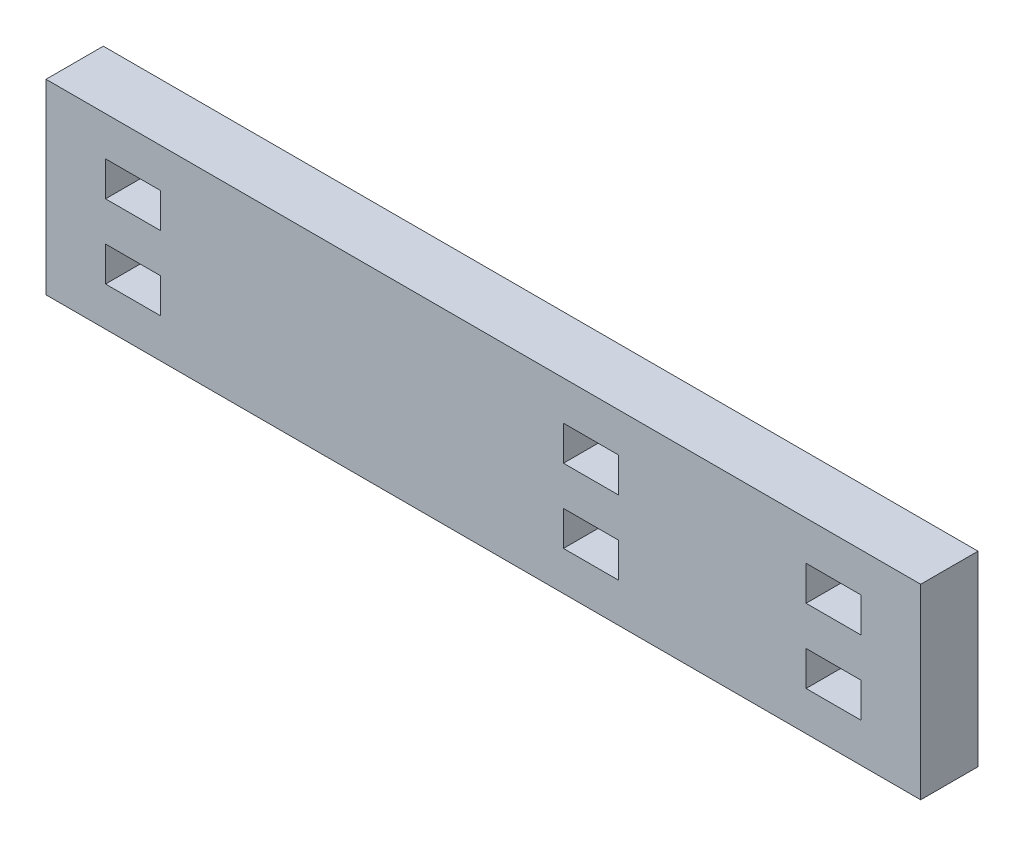
ISO-10303-21;
HEADER;
FILE_DESCRIPTION(('STEP AP214'),'2;1');
FILE_NAME('part.step','',(''),(''),'','','');
FILE_SCHEMA(('AUTOMOTIVE_DESIGN { 1 0 10303 214 1 1 1 1 }'));
ENDSEC;
DATA;
#1=APPLICATION_CONTEXT('core data for automotive mechanical design processes');
#2=APPLICATION_PROTOCOL_DEFINITION('international standard','automotive_design',2000,#1);
#3=PRODUCT_CONTEXT('',#1,'mechanical');
#4=PRODUCT('Part','Part','',(#3));
#5=PRODUCT_RELATED_PRODUCT_CATEGORY('part','',(#4));
#6=PRODUCT_DEFINITION_FORMATION('','',#4);
#7=PRODUCT_DEFINITION_CONTEXT('part definition',#1,'design');
#8=PRODUCT_DEFINITION('design','',#6,#7);
#9=PRODUCT_DEFINITION_SHAPE('','',#8);
#10=(LENGTH_UNIT() NAMED_UNIT(*) SI_UNIT(.MILLI.,.METRE.));
#11=(NAMED_UNIT(*) PLANE_ANGLE_UNIT() SI_UNIT($,.RADIAN.));
#12=(NAMED_UNIT(*) SI_UNIT($,.STERADIAN.) SOLID_ANGLE_UNIT());
#13=UNCERTAINTY_MEASURE_WITH_UNIT(LENGTH_MEASURE(1.E-05),#10,'distance_accuracy_value','');
#14=(GEOMETRIC_REPRESENTATION_CONTEXT(3) GLOBAL_UNCERTAINTY_ASSIGNED_CONTEXT((#13)) GLOBAL_UNIT_ASSIGNED_CONTEXT((#10,
#11,#12)) REPRESENTATION_CONTEXT('',''));
#15=CARTESIAN_POINT('',(0.,0.,0.));
#16=DIRECTION('',(0.,0.,1.));
#17=DIRECTION('',(1.,0.,0.));
#18=AXIS2_PLACEMENT_3D('',#15,#16,#17);
#19=CARTESIAN_POINT('',(-0.1,-0.1,5.15));
#20=DIRECTION('',(0.,0.,-1.));
#21=DIRECTION('',(-1.,0.,0.));
#22=AXIS2_PLACEMENT_3D('',#19,#20,#21);
#23=PLANE('',#22);
#24=DIRECTION('',(0.,-1.,0.));
#25=VECTOR('',#24,1.);
#26=CARTESIAN_POINT('',(73.15,0.,5.15));
#27=LINE('',#26,#25);
#28=CARTESIAN_POINT('',(73.15,13.1616,5.15));
#29=VERTEX_POINT('',#28);
#30=CARTESIAN_POINT('',(73.15,10.0462,5.15));
#31=VERTEX_POINT('',#30);
#32=EDGE_CURVE('E260',#29,#31,#27,.T.);
#33=ORIENTED_EDGE('',*,*,#32,.T.);
#34=DIRECTION('',(-1.,0.,0.));
#35=VECTOR('',#34,1.);
#36=CARTESIAN_POINT('',(0.,10.0462,5.15));
#37=LINE('',#36,#35);
#38=CARTESIAN_POINT('',(68.2,10.0462,5.15));
#39=VERTEX_POINT('',#38);
#40=EDGE_CURVE('E267',#31,#39,#37,.T.);
#41=ORIENTED_EDGE('',*,*,#40,.T.);
#42=DIRECTION('',(0.,-1.,0.));
#43=VECTOR('',#42,1.);
#44=CARTESIAN_POINT('',(68.2,0.,5.15));
#45=LINE('',#44,#43);
#46=CARTESIAN_POINT('',(68.2,13.1616,5.15));
#47=VERTEX_POINT('',#46);
#48=EDGE_CURVE('E290',#47,#39,#45,.T.);
#49=ORIENTED_EDGE('',*,*,#48,.F.);
#50=DIRECTION('',(-1.,0.,0.));
#51=VECTOR('',#50,1.);
#52=CARTESIAN_POINT('',(0.,13.1616,5.15));
#53=LINE('',#52,#51);
#54=EDGE_CURVE('E279',#29,#47,#53,.T.);
#55=ORIENTED_EDGE('',*,*,#54,.F.);
#56=EDGE_LOOP('',(#33,#41,#49,#55));
#57=FACE_BOUND('',#56,.T.);
#58=DIRECTION('',(1.,0.,0.));
#59=VECTOR('',#58,1.);
#60=CARTESIAN_POINT('',(0.,13.1616,5.15));
#61=LINE('',#60,#59);
#62=CARTESIAN_POINT('',(46.4,13.1616,5.15));
#63=VERTEX_POINT('',#62);
#64=CARTESIAN_POINT('',(51.35,13.1616,5.15));
#65=VERTEX_POINT('',#64);
#66=EDGE_CURVE('E333',#63,#65,#61,.T.);
#67=ORIENTED_EDGE('',*,*,#66,.T.);
#68=DIRECTION('',(0.,-1.,0.));
#69=VECTOR('',#68,1.);
#70=CARTESIAN_POINT('',(51.35,0.,5.15));
#71=LINE('',#70,#69);
#72=CARTESIAN_POINT('',(51.35,10.0462,5.15));
#73=VERTEX_POINT('',#72);
#74=EDGE_CURVE('E343',#65,#73,#71,.T.);
#75=ORIENTED_EDGE('',*,*,#74,.T.);
#76=DIRECTION('',(1.,0.,0.));
#77=VECTOR('',#76,1.);
#78=CARTESIAN_POINT('',(0.,10.0462,5.15));
#79=LINE('',#78,#77);
#80=CARTESIAN_POINT('',(46.4,10.0462,5.15));
#81=VERTEX_POINT('',#80);
#82=EDGE_CURVE('E366',#81,#73,#79,.T.);
#83=ORIENTED_EDGE('',*,*,#82,.F.);
#84=DIRECTION('',(0.,-1.,0.));
#85=VECTOR('',#84,1.);
#86=CARTESIAN_POINT('',(46.4,0.,5.15));
#87=LINE('',#86,#85);
#88=EDGE_CURVE('E355',#63,#81,#87,.T.);
#89=ORIENTED_EDGE('',*,*,#88,.F.);
#90=EDGE_LOOP('',(#67,#75,#83,#89));
#91=FACE_BOUND('',#90,.T.);
#92=DIRECTION('',(1.,0.,0.));
#93=VECTOR('',#92,1.);
#94=CARTESIAN_POINT('',(0.,13.1616,5.15));
#95=LINE('',#94,#93);
#96=CARTESIAN_POINT('',(5.25,13.1616,5.15));
#97=VERTEX_POINT('',#96);
#98=CARTESIAN_POINT('',(10.2,13.1616,5.15));
#99=VERTEX_POINT('',#98);
#100=EDGE_CURVE('E409',#97,#99,#95,.T.);
#101=ORIENTED_EDGE('',*,*,#100,.T.);
#102=DIRECTION('',(0.,-1.,0.));
#103=VECTOR('',#102,1.);
#104=CARTESIAN_POINT('',(10.2,0.,5.15));
#105=LINE('',#104,#103);
#106=CARTESIAN_POINT('',(10.2,10.0462,5.15));
#107=VERTEX_POINT('',#106);
#108=EDGE_CURVE('E419',#99,#107,#105,.T.);
#109=ORIENTED_EDGE('',*,*,#108,.T.);
#110=DIRECTION('',(1.,0.,0.));
#111=VECTOR('',#110,1.);
#112=CARTESIAN_POINT('',(0.,10.0462,5.15));
#113=LINE('',#112,#111);
#114=CARTESIAN_POINT('',(5.25,10.0462,5.15));
#115=VERTEX_POINT('',#114);
#116=EDGE_CURVE('E442',#115,#107,#113,.T.);
#117=ORIENTED_EDGE('',*,*,#116,.F.);
#118=DIRECTION('',(0.,-1.,0.));
#119=VECTOR('',#118,1.);
#120=CARTESIAN_POINT('',(5.25,0.,5.15));
#121=LINE('',#120,#119);
#122=EDGE_CURVE('E431',#97,#115,#121,.T.);
#123=ORIENTED_EDGE('',*,*,#122,.F.);
#124=EDGE_LOOP('',(#101,#109,#117,#123));
#125=FACE_BOUND('',#124,.T.);
#126=DIRECTION('',(1.,0.,0.));
#127=VECTOR('',#126,1.);
#128=CARTESIAN_POINT('',(78.5,-0.1,5.15));
#129=LINE('',#128,#127);
#130=CARTESIAN_POINT('',(-0.1,-0.1,5.15));
#131=VERTEX_POINT('',#130);
#132=CARTESIAN_POINT('',(78.5,-0.1,5.15));
#133=VERTEX_POINT('',#132);
#134=EDGE_CURVE('E454',#131,#133,#129,.T.);
#135=ORIENTED_EDGE('',*,*,#134,.T.);
#136=DIRECTION('',(0.,1.,0.));
#137=VECTOR('',#136,1.);
#138=CARTESIAN_POINT('',(78.5,16.677,5.15));
#139=LINE('',#138,#137);
#140=CARTESIAN_POINT('',(78.5,16.677,5.15));
#141=VERTEX_POINT('',#140);
#142=EDGE_CURVE('E458',#133,#141,#139,.T.);
#143=ORIENTED_EDGE('',*,*,#142,.T.);
#144=DIRECTION('',(-1.,0.,0.));
#145=VECTOR('',#144,1.);
#146=CARTESIAN_POINT('',(-0.1,16.677,5.15));
#147=LINE('',#146,#145);
#148=CARTESIAN_POINT('',(-0.1,16.677,5.15));
#149=VERTEX_POINT('',#148);
#150=EDGE_CURVE('E464',#141,#149,#147,.T.);
#151=ORIENTED_EDGE('',*,*,#150,.T.);
#152=DIRECTION('',(0.,-1.,0.));
#153=VECTOR('',#152,1.);
#154=CARTESIAN_POINT('',(-0.1,-0.1,5.15));
#155=LINE('',#154,#153);
#156=EDGE_CURVE('E466',#149,#131,#155,.T.);
#157=ORIENTED_EDGE('',*,*,#156,.T.);
#158=EDGE_LOOP('',(#135,#143,#151,#157));
#159=FACE_BOUND('',#158,.T.);
#160=DIRECTION('',(1.,0.,0.));
#161=VECTOR('',#160,1.);
#162=CARTESIAN_POINT('',(0.,6.5308,5.15));
#163=LINE('',#162,#161);
#164=CARTESIAN_POINT('',(5.25,6.5308,5.15));
#165=VERTEX_POINT('',#164);
#166=CARTESIAN_POINT('',(10.2,6.5308,5.15));
#167=VERTEX_POINT('',#166);
#168=EDGE_CURVE('E371',#165,#167,#163,.T.);
#169=ORIENTED_EDGE('',*,*,#168,.T.);
#170=DIRECTION('',(0.,-1.,0.));
#171=VECTOR('',#170,1.);
#172=CARTESIAN_POINT('',(10.2,0.,5.15));
#173=LINE('',#172,#171);
#174=CARTESIAN_POINT('',(10.2,3.41540000000001,5.15));
#175=VERTEX_POINT('',#174);
#176=EDGE_CURVE('E381',#167,#175,#173,.T.);
#177=ORIENTED_EDGE('',*,*,#176,.T.);
#178=DIRECTION('',(1.,0.,0.));
#179=VECTOR('',#178,1.);
#180=CARTESIAN_POINT('',(0.,3.41540000000001,5.15));
#181=LINE('',#180,#179);
#182=CARTESIAN_POINT('',(5.25,3.41540000000001,5.15));
#183=VERTEX_POINT('',#182);
#184=EDGE_CURVE('E404',#183,#175,#181,.T.);
#185=ORIENTED_EDGE('',*,*,#184,.F.);
#186=DIRECTION('',(0.,-1.,0.));
#187=VECTOR('',#186,1.);
#188=CARTESIAN_POINT('',(5.25,0.,5.15));
#189=LINE('',#188,#187);
#190=EDGE_CURVE('E392',#165,#183,#189,.T.);
#191=ORIENTED_EDGE('',*,*,#190,.F.);
#192=EDGE_LOOP('',(#169,#177,#185,#191));
#193=FACE_BOUND('',#192,.T.);
#194=DIRECTION('',(1.,0.,0.));
#195=VECTOR('',#194,1.);
#196=CARTESIAN_POINT('',(0.,6.53080000000001,5.15));
#197=LINE('',#196,#195);
#198=CARTESIAN_POINT('',(46.4,6.53080000000001,5.15));
#199=VERTEX_POINT('',#198);
#200=CARTESIAN_POINT('',(51.35,6.53080000000001,5.15));
#201=VERTEX_POINT('',#200);
#202=EDGE_CURVE('E295',#199,#201,#197,.T.);
#203=ORIENTED_EDGE('',*,*,#202,.T.);
#204=DIRECTION('',(0.,-1.,0.));
#205=VECTOR('',#204,1.);
#206=CARTESIAN_POINT('',(51.35,0.,5.15));
#207=LINE('',#206,#205);
#208=CARTESIAN_POINT('',(51.35,3.4154,5.15));
#209=VERTEX_POINT('',#208);
#210=EDGE_CURVE('E305',#201,#209,#207,.T.);
#211=ORIENTED_EDGE('',*,*,#210,.T.);
#212=DIRECTION('',(1.,0.,0.));
#213=VECTOR('',#212,1.);
#214=CARTESIAN_POINT('',(0.,3.4154,5.15));
#215=LINE('',#214,#213);
#216=CARTESIAN_POINT('',(46.4,3.4154,5.15));
#217=VERTEX_POINT('',#216);
#218=EDGE_CURVE('E328',#217,#209,#215,.T.);
#219=ORIENTED_EDGE('',*,*,#218,.F.);
#220=DIRECTION('',(0.,-1.,0.));
#221=VECTOR('',#220,1.);
#222=CARTESIAN_POINT('',(46.4,0.,5.15));
#223=LINE('',#222,#221);
#224=EDGE_CURVE('E316',#199,#217,#223,.T.);
#225=ORIENTED_EDGE('',*,*,#224,.F.);
#226=EDGE_LOOP('',(#203,#211,#219,#225));
#227=FACE_BOUND('',#226,.T.);
#228=DIRECTION('',(0.,-1.,0.));
#229=VECTOR('',#228,1.);
#230=CARTESIAN_POINT('',(73.15,0.,5.15));
#231=LINE('',#230,#229);
#232=CARTESIAN_POINT('',(73.15,6.53080000000001,5.15));
#233=VERTEX_POINT('',#232);
#234=CARTESIAN_POINT('',(73.15,3.41540000000002,5.15));
#235=VERTEX_POINT('',#234);
#236=EDGE_CURVE('E50',#233,#235,#231,.T.);
#237=ORIENTED_EDGE('',*,*,#236,.T.);
#238=DIRECTION('',(-1.,0.,0.));
#239=VECTOR('',#238,1.);
#240=CARTESIAN_POINT('',(0.,3.41540000000002,5.15));
#241=LINE('',#240,#239);
#242=CARTESIAN_POINT('',(68.2,3.41540000000002,5.15));
#243=VERTEX_POINT('',#242);
#244=EDGE_CURVE('E238',#235,#243,#241,.T.);
#245=ORIENTED_EDGE('',*,*,#244,.T.);
#246=DIRECTION('',(0.,-1.,0.));
#247=VECTOR('',#246,1.);
#248=CARTESIAN_POINT('',(68.2,0.,5.15));
#249=LINE('',#248,#247);
#250=CARTESIAN_POINT('',(68.2,6.53080000000001,5.15));
#251=VERTEX_POINT('',#250);
#252=EDGE_CURVE('E241',#251,#243,#249,.T.);
#253=ORIENTED_EDGE('',*,*,#252,.F.);
#254=DIRECTION('',(-1.,0.,0.));
#255=VECTOR('',#254,1.);
#256=CARTESIAN_POINT('',(0.,6.53080000000001,5.15));
#257=LINE('',#256,#255);
#258=EDGE_CURVE('E247',#233,#251,#257,.T.);
#259=ORIENTED_EDGE('',*,*,#258,.F.);
#260=EDGE_LOOP('',(#237,#245,#253,#259));
#261=FACE_BOUND('',#260,.T.);
#262=ADVANCED_FACE('F35',(#57,#91,#125,#159,#193,#227,#261),#23,.F.);
#263=CARTESIAN_POINT('',(-0.1,-0.1,0.));
#264=DIRECTION('',(0.,0.,-1.));
#265=DIRECTION('',(-1.,0.,0.));
#266=AXIS2_PLACEMENT_3D('',#263,#264,#265);
#267=PLANE('',#266);
#268=DIRECTION('',(-1.,0.,0.));
#269=VECTOR('',#268,1.);
#270=CARTESIAN_POINT('',(0.,10.0462,0.));
#271=LINE('',#270,#269);
#272=CARTESIAN_POINT('',(73.15,10.0462,0.));
#273=VERTEX_POINT('',#272);
#274=CARTESIAN_POINT('',(68.2,10.0462,0.));
#275=VERTEX_POINT('',#274);
#276=EDGE_CURVE('E273',#273,#275,#271,.T.);
#277=ORIENTED_EDGE('',*,*,#276,.F.);
#278=DIRECTION('',(0.,-1.,0.));
#279=VECTOR('',#278,1.);
#280=CARTESIAN_POINT('',(73.15,0.,0.));
#281=LINE('',#280,#279);
#282=CARTESIAN_POINT('',(73.15,13.1616,0.));
#283=VERTEX_POINT('',#282);
#284=EDGE_CURVE('E264',#283,#273,#281,.T.);
#285=ORIENTED_EDGE('',*,*,#284,.F.);
#286=DIRECTION('',(-1.,0.,0.));
#287=VECTOR('',#286,1.);
#288=CARTESIAN_POINT('',(0.,13.1616,0.));
#289=LINE('',#288,#287);
#290=CARTESIAN_POINT('',(68.2,13.1616,0.));
#291=VERTEX_POINT('',#290);
#292=EDGE_CURVE('E266',#283,#291,#289,.T.);
#293=ORIENTED_EDGE('',*,*,#292,.T.);
#294=DIRECTION('',(0.,-1.,0.));
#295=VECTOR('',#294,1.);
#296=CARTESIAN_POINT('',(68.2,0.,0.));
#297=LINE('',#296,#295);
#298=EDGE_CURVE('E270',#291,#275,#297,.T.);
#299=ORIENTED_EDGE('',*,*,#298,.T.);
#300=EDGE_LOOP('',(#277,#285,#293,#299));
#301=FACE_BOUND('',#300,.T.);
#302=DIRECTION('',(0.,-1.,0.));
#303=VECTOR('',#302,1.);
#304=CARTESIAN_POINT('',(51.35,0.,0.));
#305=LINE('',#304,#303);
#306=CARTESIAN_POINT('',(51.35,13.1616,0.));
#307=VERTEX_POINT('',#306);
#308=CARTESIAN_POINT('',(51.35,10.0462,0.));
#309=VERTEX_POINT('',#308);
#310=EDGE_CURVE('E349',#307,#309,#305,.T.);
#311=ORIENTED_EDGE('',*,*,#310,.F.);
#312=DIRECTION('',(1.,0.,0.));
#313=VECTOR('',#312,1.);
#314=CARTESIAN_POINT('',(0.,13.1616,0.));
#315=LINE('',#314,#313);
#316=CARTESIAN_POINT('',(46.4,13.1616,0.));
#317=VERTEX_POINT('',#316);
#318=EDGE_CURVE('E340',#317,#307,#315,.T.);
#319=ORIENTED_EDGE('',*,*,#318,.F.);
#320=DIRECTION('',(0.,-1.,0.));
#321=VECTOR('',#320,1.);
#322=CARTESIAN_POINT('',(46.4,0.,0.));
#323=LINE('',#322,#321);
#324=CARTESIAN_POINT('',(46.4,10.0462,0.));
#325=VERTEX_POINT('',#324);
#326=EDGE_CURVE('E342',#317,#325,#323,.T.);
#327=ORIENTED_EDGE('',*,*,#326,.T.);
#328=DIRECTION('',(1.,0.,0.));
#329=VECTOR('',#328,1.);
#330=CARTESIAN_POINT('',(0.,10.0462,0.));
#331=LINE('',#330,#329);
#332=EDGE_CURVE('E346',#325,#309,#331,.T.);
#333=ORIENTED_EDGE('',*,*,#332,.T.);
#334=EDGE_LOOP('',(#311,#319,#327,#333));
#335=FACE_BOUND('',#334,.T.);
#336=DIRECTION('',(0.,-1.,0.));
#337=VECTOR('',#336,1.);
#338=CARTESIAN_POINT('',(10.2,0.,0.));
#339=LINE('',#338,#337);
#340=CARTESIAN_POINT('',(10.2,13.1616,0.));
#341=VERTEX_POINT('',#340);
#342=CARTESIAN_POINT('',(10.2,10.0462,0.));
#343=VERTEX_POINT('',#342);
#344=EDGE_CURVE('E425',#341,#343,#339,.T.);
#345=ORIENTED_EDGE('',*,*,#344,.F.);
#346=DIRECTION('',(1.,0.,0.));
#347=VECTOR('',#346,1.);
#348=CARTESIAN_POINT('',(0.,13.1616,0.));
#349=LINE('',#348,#347);
#350=CARTESIAN_POINT('',(5.25,13.1616,0.));
#351=VERTEX_POINT('',#350);
#352=EDGE_CURVE('E416',#351,#341,#349,.T.);
#353=ORIENTED_EDGE('',*,*,#352,.F.);
#354=DIRECTION('',(0.,-1.,0.));
#355=VECTOR('',#354,1.);
#356=CARTESIAN_POINT('',(5.25,0.,0.));
#357=LINE('',#356,#355);
#358=CARTESIAN_POINT('',(5.25,10.0462,0.));
#359=VERTEX_POINT('',#358);
#360=EDGE_CURVE('E418',#351,#359,#357,.T.);
#361=ORIENTED_EDGE('',*,*,#360,.T.);
#362=DIRECTION('',(1.,0.,0.));
#363=VECTOR('',#362,1.);
#364=CARTESIAN_POINT('',(0.,10.0462,0.));
#365=LINE('',#364,#363);
#366=EDGE_CURVE('E422',#359,#343,#365,.T.);
#367=ORIENTED_EDGE('',*,*,#366,.T.);
#368=EDGE_LOOP('',(#345,#353,#361,#367));
#369=FACE_BOUND('',#368,.T.);
#370=DIRECTION('',(1.,0.,0.));
#371=VECTOR('',#370,1.);
#372=CARTESIAN_POINT('',(78.5,-0.1,0.));
#373=LINE('',#372,#371);
#374=CARTESIAN_POINT('',(-0.1,-0.1,0.));
#375=VERTEX_POINT('',#374);
#376=CARTESIAN_POINT('',(78.5,-0.1,0.));
#377=VERTEX_POINT('',#376);
#378=EDGE_CURVE('E447',#375,#377,#373,.T.);
#379=ORIENTED_EDGE('',*,*,#378,.F.);
#380=DIRECTION('',(0.,-1.,0.));
#381=VECTOR('',#380,1.);
#382=CARTESIAN_POINT('',(-0.1,-0.1,0.));
#383=LINE('',#382,#381);
#384=CARTESIAN_POINT('',(-0.1,16.677,0.));
#385=VERTEX_POINT('',#384);
#386=EDGE_CURVE('E459',#385,#375,#383,.T.);
#387=ORIENTED_EDGE('',*,*,#386,.F.);
#388=DIRECTION('',(-1.,0.,0.));
#389=VECTOR('',#388,1.);
#390=CARTESIAN_POINT('',(-0.1,16.677,0.));
#391=LINE('',#390,#389);
#392=CARTESIAN_POINT('',(78.5,16.677,0.));
#393=VERTEX_POINT('',#392);
#394=EDGE_CURVE('E474',#393,#385,#391,.T.);
#395=ORIENTED_EDGE('',*,*,#394,.F.);
#396=DIRECTION('',(0.,1.,0.));
#397=VECTOR('',#396,1.);
#398=CARTESIAN_POINT('',(78.5,16.677,0.));
#399=LINE('',#398,#397);
#400=EDGE_CURVE('E472',#377,#393,#399,.T.);
#401=ORIENTED_EDGE('',*,*,#400,.F.);
#402=EDGE_LOOP('',(#379,#387,#395,#401));
#403=FACE_BOUND('',#402,.T.);
#404=DIRECTION('',(0.,-1.,0.));
#405=VECTOR('',#404,1.);
#406=CARTESIAN_POINT('',(10.2,0.,0.));
#407=LINE('',#406,#405);
#408=CARTESIAN_POINT('',(10.2,6.5308,0.));
#409=VERTEX_POINT('',#408);
#410=CARTESIAN_POINT('',(10.2,3.41540000000001,0.));
#411=VERTEX_POINT('',#410);
#412=EDGE_CURVE('E387',#409,#411,#407,.T.);
#413=ORIENTED_EDGE('',*,*,#412,.F.);
#414=DIRECTION('',(1.,0.,0.));
#415=VECTOR('',#414,1.);
#416=CARTESIAN_POINT('',(0.,6.5308,0.));
#417=LINE('',#416,#415);
#418=CARTESIAN_POINT('',(5.25,6.5308,0.));
#419=VERTEX_POINT('',#418);
#420=EDGE_CURVE('E378',#419,#409,#417,.T.);
#421=ORIENTED_EDGE('',*,*,#420,.F.);
#422=DIRECTION('',(0.,-1.,0.));
#423=VECTOR('',#422,1.);
#424=CARTESIAN_POINT('',(5.25,0.,0.));
#425=LINE('',#424,#423);
#426=CARTESIAN_POINT('',(5.25,3.41540000000001,0.));
#427=VERTEX_POINT('',#426);
#428=EDGE_CURVE('E380',#419,#427,#425,.T.);
#429=ORIENTED_EDGE('',*,*,#428,.T.);
#430=DIRECTION('',(1.,0.,0.));
#431=VECTOR('',#430,1.);
#432=CARTESIAN_POINT('',(0.,3.41540000000001,0.));
#433=LINE('',#432,#431);
#434=EDGE_CURVE('E384',#427,#411,#433,.T.);
#435=ORIENTED_EDGE('',*,*,#434,.T.);
#436=EDGE_LOOP('',(#413,#421,#429,#435));
#437=FACE_BOUND('',#436,.T.);
#438=DIRECTION('',(0.,-1.,0.));
#439=VECTOR('',#438,1.);
#440=CARTESIAN_POINT('',(51.35,0.,0.));
#441=LINE('',#440,#439);
#442=CARTESIAN_POINT('',(51.35,6.53080000000001,0.));
#443=VERTEX_POINT('',#442);
#444=CARTESIAN_POINT('',(51.35,3.4154,0.));
#445=VERTEX_POINT('',#444);
#446=EDGE_CURVE('E311',#443,#445,#441,.T.);
#447=ORIENTED_EDGE('',*,*,#446,.F.);
#448=DIRECTION('',(1.,0.,0.));
#449=VECTOR('',#448,1.);
#450=CARTESIAN_POINT('',(0.,6.53080000000001,0.));
#451=LINE('',#450,#449);
#452=CARTESIAN_POINT('',(46.4,6.53080000000001,0.));
#453=VERTEX_POINT('',#452);
#454=EDGE_CURVE('E302',#453,#443,#451,.T.);
#455=ORIENTED_EDGE('',*,*,#454,.F.);
#456=DIRECTION('',(0.,-1.,0.));
#457=VECTOR('',#456,1.);
#458=CARTESIAN_POINT('',(46.4,0.,0.));
#459=LINE('',#458,#457);
#460=CARTESIAN_POINT('',(46.4,3.4154,0.));
#461=VERTEX_POINT('',#460);
#462=EDGE_CURVE('E304',#453,#461,#459,.T.);
#463=ORIENTED_EDGE('',*,*,#462,.T.);
#464=DIRECTION('',(1.,0.,0.));
#465=VECTOR('',#464,1.);
#466=CARTESIAN_POINT('',(0.,3.4154,0.));
#467=LINE('',#466,#465);
#468=EDGE_CURVE('E308',#461,#445,#467,.T.);
#469=ORIENTED_EDGE('',*,*,#468,.T.);
#470=EDGE_LOOP('',(#447,#455,#463,#469));
#471=FACE_BOUND('',#470,.T.);
#472=DIRECTION('',(-1.,0.,0.));
#473=VECTOR('',#472,1.);
#474=CARTESIAN_POINT('',(0.,3.41540000000002,0.));
#475=LINE('',#474,#473);
#476=CARTESIAN_POINT('',(73.15,3.41540000000002,0.));
#477=VERTEX_POINT('',#476);
#478=CARTESIAN_POINT('',(68.2,3.41540000000002,0.));
#479=VERTEX_POINT('',#478);
#480=EDGE_CURVE('E229',#477,#479,#475,.T.);
#481=ORIENTED_EDGE('',*,*,#480,.F.);
#482=DIRECTION('',(0.,-1.,0.));
#483=VECTOR('',#482,1.);
#484=CARTESIAN_POINT('',(73.15,0.,0.));
#485=LINE('',#484,#483);
#486=CARTESIAN_POINT('',(73.15,6.53080000000001,0.));
#487=VERTEX_POINT('',#486);
#488=EDGE_CURVE('E223',#487,#477,#485,.T.);
#489=ORIENTED_EDGE('',*,*,#488,.F.);
#490=DIRECTION('',(-1.,0.,0.));
#491=VECTOR('',#490,1.);
#492=CARTESIAN_POINT('',(0.,6.53080000000001,0.));
#493=LINE('',#492,#491);
#494=CARTESIAN_POINT('',(68.2,6.53080000000001,0.));
#495=VERTEX_POINT('',#494);
#496=EDGE_CURVE('E232',#487,#495,#493,.T.);
#497=ORIENTED_EDGE('',*,*,#496,.T.);
#498=DIRECTION('',(0.,-1.,0.));
#499=VECTOR('',#498,1.);
#500=CARTESIAN_POINT('',(68.2,0.,0.));
#501=LINE('',#500,#499);
#502=EDGE_CURVE('E58',#495,#479,#501,.T.);
#503=ORIENTED_EDGE('',*,*,#502,.T.);
#504=EDGE_LOOP('',(#481,#489,#497,#503));
#505=FACE_BOUND('',#504,.T.);
#506=ADVANCED_FACE('F237',(#301,#335,#369,#403,#437,#471,#505),#267,.T.);
#507=CARTESIAN_POINT('',(78.5,-0.1,5.15));
#508=DIRECTION('',(0.,1.,0.));
#509=DIRECTION('',(0.,0.,1.));
#510=AXIS2_PLACEMENT_3D('',#507,#508,#509);
#511=PLANE('',#510);
#512=ORIENTED_EDGE('',*,*,#378,.T.);
#513=DIRECTION('',(0.,0.,-1.));
#514=VECTOR('',#513,1.);
#515=CARTESIAN_POINT('',(78.5,-0.1,5.15));
#516=LINE('',#515,#514);
#517=EDGE_CURVE('E12',#133,#377,#516,.T.);
#518=ORIENTED_EDGE('',*,*,#517,.F.);
#519=ORIENTED_EDGE('',*,*,#134,.F.);
#520=DIRECTION('',(0.,0.,-1.));
#521=VECTOR('',#520,1.);
#522=CARTESIAN_POINT('',(-0.1,-0.1,5.15));
#523=LINE('',#522,#521);
#524=EDGE_CURVE('E469',#131,#375,#523,.T.);
#525=ORIENTED_EDGE('',*,*,#524,.T.);
#526=EDGE_LOOP('',(#512,#518,#519,#525));
#527=FACE_BOUND('',#526,.T.);
#528=ADVANCED_FACE('F37',(#527),#511,.F.);
#529=CARTESIAN_POINT('',(78.5,16.677,5.15));
#530=DIRECTION('',(-1.,0.,0.));
#531=DIRECTION('',(0.,0.,1.));
#532=AXIS2_PLACEMENT_3D('',#529,#530,#531);
#533=PLANE('',#532);
#534=ORIENTED_EDGE('',*,*,#400,.T.);
#535=DIRECTION('',(0.,0.,-1.));
#536=VECTOR('',#535,1.);
#537=CARTESIAN_POINT('',(78.5,16.677,5.15));
#538=LINE('',#537,#536);
#539=EDGE_CURVE('E43',#141,#393,#538,.T.);
#540=ORIENTED_EDGE('',*,*,#539,.F.);
#541=ORIENTED_EDGE('',*,*,#142,.F.);
#542=ORIENTED_EDGE('',*,*,#517,.T.);
#543=EDGE_LOOP('',(#534,#540,#541,#542));
#544=FACE_BOUND('',#543,.T.);
#545=ADVANCED_FACE('F502',(#544),#533,.F.);
#546=CARTESIAN_POINT('',(-0.1,16.677,5.15));
#547=DIRECTION('',(0.,-1.,0.));
#548=DIRECTION('',(0.,0.,-1.));
#549=AXIS2_PLACEMENT_3D('',#546,#547,#548);
#550=PLANE('',#549);
#551=ORIENTED_EDGE('',*,*,#394,.T.);
#552=DIRECTION('',(0.,0.,-1.));
#553=VECTOR('',#552,1.);
#554=CARTESIAN_POINT('',(-0.1,16.677,5.15));
#555=LINE('',#554,#553);
#556=EDGE_CURVE('E479',#149,#385,#555,.T.);
#557=ORIENTED_EDGE('',*,*,#556,.F.);
#558=ORIENTED_EDGE('',*,*,#150,.F.);
#559=ORIENTED_EDGE('',*,*,#539,.T.);
#560=EDGE_LOOP('',(#551,#557,#558,#559));
#561=FACE_BOUND('',#560,.T.);
#562=ADVANCED_FACE('F486',(#561),#550,.F.);
#563=CARTESIAN_POINT('',(-0.1,-0.1,5.15));
#564=DIRECTION('',(1.,0.,0.));
#565=DIRECTION('',(0.,0.,-1.));
#566=AXIS2_PLACEMENT_3D('',#563,#564,#565);
#567=PLANE('',#566);
#568=ORIENTED_EDGE('',*,*,#386,.T.);
#569=ORIENTED_EDGE('',*,*,#524,.F.);
#570=ORIENTED_EDGE('',*,*,#156,.F.);
#571=ORIENTED_EDGE('',*,*,#556,.T.);
#572=EDGE_LOOP('',(#568,#569,#570,#571));
#573=FACE_BOUND('',#572,.T.);
#574=ADVANCED_FACE('F495',(#573),#567,.F.);
#575=CARTESIAN_POINT('',(0.,13.1616,0.));
#576=DIRECTION('',(0.,-1.,0.));
#577=DIRECTION('',(0.,0.,-1.));
#578=AXIS2_PLACEMENT_3D('',#575,#576,#577);
#579=PLANE('',#578);
#580=ORIENTED_EDGE('',*,*,#100,.F.);
#581=DIRECTION('',(0.,0.,1.));
#582=VECTOR('',#581,1.);
#583=CARTESIAN_POINT('',(5.25,13.1616,0.));
#584=LINE('',#583,#582);
#585=EDGE_CURVE('E427',#351,#97,#584,.T.);
#586=ORIENTED_EDGE('',*,*,#585,.F.);
#587=ORIENTED_EDGE('',*,*,#352,.T.);
#588=DIRECTION('',(0.,0.,1.));
#589=VECTOR('',#588,1.);
#590=CARTESIAN_POINT('',(10.2,13.1616,0.));
#591=LINE('',#590,#589);
#592=EDGE_CURVE('E444',#341,#99,#591,.T.);
#593=ORIENTED_EDGE('',*,*,#592,.T.);
#594=EDGE_LOOP('',(#580,#586,#587,#593));
#595=FACE_BOUND('',#594,.T.);
#596=ADVANCED_FACE('F519',(#595),#579,.T.);
#597=CARTESIAN_POINT('',(10.2,0.,0.));
#598=DIRECTION('',(-1.,0.,0.));
#599=DIRECTION('',(0.,0.,1.));
#600=AXIS2_PLACEMENT_3D('',#597,#598,#599);
#601=PLANE('',#600);
#602=ORIENTED_EDGE('',*,*,#108,.F.);
#603=ORIENTED_EDGE('',*,*,#592,.F.);
#604=ORIENTED_EDGE('',*,*,#344,.T.);
#605=DIRECTION('',(0.,0.,1.));
#606=VECTOR('',#605,1.);
#607=CARTESIAN_POINT('',(10.2,10.0462,0.));
#608=LINE('',#607,#606);
#609=EDGE_CURVE('E448',#343,#107,#608,.T.);
#610=ORIENTED_EDGE('',*,*,#609,.T.);
#611=EDGE_LOOP('',(#602,#603,#604,#610));
#612=FACE_BOUND('',#611,.T.);
#613=ADVANCED_FACE('F526',(#612),#601,.T.);
#614=CARTESIAN_POINT('',(0.,10.0462,0.));
#615=DIRECTION('',(0.,-1.,0.));
#616=DIRECTION('',(0.,0.,-1.));
#617=AXIS2_PLACEMENT_3D('',#614,#615,#616);
#618=PLANE('',#617);
#619=ORIENTED_EDGE('',*,*,#116,.T.);
#620=ORIENTED_EDGE('',*,*,#609,.F.);
#621=ORIENTED_EDGE('',*,*,#366,.F.);
#622=DIRECTION('',(0.,0.,1.));
#623=VECTOR('',#622,1.);
#624=CARTESIAN_POINT('',(5.25,10.0462,0.));
#625=LINE('',#624,#623);
#626=EDGE_CURVE('E450',#359,#115,#625,.T.);
#627=ORIENTED_EDGE('',*,*,#626,.T.);
#628=EDGE_LOOP('',(#619,#620,#621,#627));
#629=FACE_BOUND('',#628,.T.);
#630=ADVANCED_FACE('F531',(#629),#618,.F.);
#631=CARTESIAN_POINT('',(5.25,0.,0.));
#632=DIRECTION('',(-1.,0.,0.));
#633=DIRECTION('',(0.,0.,1.));
#634=AXIS2_PLACEMENT_3D('',#631,#632,#633);
#635=PLANE('',#634);
#636=ORIENTED_EDGE('',*,*,#122,.T.);
#637=ORIENTED_EDGE('',*,*,#626,.F.);
#638=ORIENTED_EDGE('',*,*,#360,.F.);
#639=ORIENTED_EDGE('',*,*,#585,.T.);
#640=EDGE_LOOP('',(#636,#637,#638,#639));
#641=FACE_BOUND('',#640,.T.);
#642=ADVANCED_FACE('F540',(#641),#635,.F.);
#643=CARTESIAN_POINT('',(0.,6.5308,0.));
#644=DIRECTION('',(0.,-1.,0.));
#645=DIRECTION('',(0.,0.,-1.));
#646=AXIS2_PLACEMENT_3D('',#643,#644,#645);
#647=PLANE('',#646);
#648=ORIENTED_EDGE('',*,*,#168,.F.);
#649=DIRECTION('',(0.,0.,1.));
#650=VECTOR('',#649,1.);
#651=CARTESIAN_POINT('',(5.25,6.5308,0.));
#652=LINE('',#651,#650);
#653=EDGE_CURVE('E389',#419,#165,#652,.T.);
#654=ORIENTED_EDGE('',*,*,#653,.F.);
#655=ORIENTED_EDGE('',*,*,#420,.T.);
#656=DIRECTION('',(0.,0.,1.));
#657=VECTOR('',#656,1.);
#658=CARTESIAN_POINT('',(10.2,6.5308,0.));
#659=LINE('',#658,#657);
#660=EDGE_CURVE('E406',#409,#167,#659,.T.);
#661=ORIENTED_EDGE('',*,*,#660,.T.);
#662=EDGE_LOOP('',(#648,#654,#655,#661));
#663=FACE_BOUND('',#662,.T.);
#664=ADVANCED_FACE('F554',(#663),#647,.T.);
#665=CARTESIAN_POINT('',(10.2,0.,0.));
#666=DIRECTION('',(-1.,0.,0.));
#667=DIRECTION('',(0.,0.,1.));
#668=AXIS2_PLACEMENT_3D('',#665,#666,#667);
#669=PLANE('',#668);
#670=ORIENTED_EDGE('',*,*,#176,.F.);
#671=ORIENTED_EDGE('',*,*,#660,.F.);
#672=ORIENTED_EDGE('',*,*,#412,.T.);
#673=DIRECTION('',(0.,0.,1.));
#674=VECTOR('',#673,1.);
#675=CARTESIAN_POINT('',(10.2,3.41540000000001,0.));
#676=LINE('',#675,#674);
#677=EDGE_CURVE('E410',#411,#175,#676,.T.);
#678=ORIENTED_EDGE('',*,*,#677,.T.);
#679=EDGE_LOOP('',(#670,#671,#672,#678));
#680=FACE_BOUND('',#679,.T.);
#681=ADVANCED_FACE('F558',(#680),#669,.T.);
#682=CARTESIAN_POINT('',(0.,3.41540000000001,0.));
#683=DIRECTION('',(0.,-1.,0.));
#684=DIRECTION('',(0.,0.,-1.));
#685=AXIS2_PLACEMENT_3D('',#682,#683,#684);
#686=PLANE('',#685);
#687=ORIENTED_EDGE('',*,*,#184,.T.);
#688=ORIENTED_EDGE('',*,*,#677,.F.);
#689=ORIENTED_EDGE('',*,*,#434,.F.);
#690=DIRECTION('',(0.,0.,1.));
#691=VECTOR('',#690,1.);
#692=CARTESIAN_POINT('',(5.25,3.41540000000001,0.));
#693=LINE('',#692,#691);
#694=EDGE_CURVE('E412',#427,#183,#693,.T.);
#695=ORIENTED_EDGE('',*,*,#694,.T.);
#696=EDGE_LOOP('',(#687,#688,#689,#695));
#697=FACE_BOUND('',#696,.T.);
#698=ADVANCED_FACE('F564',(#697),#686,.F.);
#699=CARTESIAN_POINT('',(5.25,0.,0.));
#700=DIRECTION('',(-1.,0.,0.));
#701=DIRECTION('',(0.,0.,1.));
#702=AXIS2_PLACEMENT_3D('',#699,#700,#701);
#703=PLANE('',#702);
#704=ORIENTED_EDGE('',*,*,#190,.T.);
#705=ORIENTED_EDGE('',*,*,#694,.F.);
#706=ORIENTED_EDGE('',*,*,#428,.F.);
#707=ORIENTED_EDGE('',*,*,#653,.T.);
#708=EDGE_LOOP('',(#704,#705,#706,#707));
#709=FACE_BOUND('',#708,.T.);
#710=ADVANCED_FACE('F560',(#709),#703,.F.);
#711=CARTESIAN_POINT('',(0.,13.1616,0.));
#712=DIRECTION('',(0.,-1.,0.));
#713=DIRECTION('',(0.,0.,-1.));
#714=AXIS2_PLACEMENT_3D('',#711,#712,#713);
#715=PLANE('',#714);
#716=ORIENTED_EDGE('',*,*,#66,.F.);
#717=DIRECTION('',(0.,0.,1.));
#718=VECTOR('',#717,1.);
#719=CARTESIAN_POINT('',(46.4,13.1616,0.));
#720=LINE('',#719,#718);
#721=EDGE_CURVE('E351',#317,#63,#720,.T.);
#722=ORIENTED_EDGE('',*,*,#721,.F.);
#723=ORIENTED_EDGE('',*,*,#318,.T.);
#724=DIRECTION('',(0.,0.,1.));
#725=VECTOR('',#724,1.);
#726=CARTESIAN_POINT('',(51.35,13.1616,0.));
#727=LINE('',#726,#725);
#728=EDGE_CURVE('E368',#307,#65,#727,.T.);
#729=ORIENTED_EDGE('',*,*,#728,.T.);
#730=EDGE_LOOP('',(#716,#722,#723,#729));
#731=FACE_BOUND('',#730,.T.);
#732=ADVANCED_FACE('F563',(#731),#715,.T.);
#733=CARTESIAN_POINT('',(51.35,0.,0.));
#734=DIRECTION('',(-1.,0.,0.));
#735=DIRECTION('',(0.,0.,1.));
#736=AXIS2_PLACEMENT_3D('',#733,#734,#735);
#737=PLANE('',#736);
#738=ORIENTED_EDGE('',*,*,#74,.F.);
#739=ORIENTED_EDGE('',*,*,#728,.F.);
#740=ORIENTED_EDGE('',*,*,#310,.T.);
#741=DIRECTION('',(0.,0.,1.));
#742=VECTOR('',#741,1.);
#743=CARTESIAN_POINT('',(51.35,10.0462,0.));
#744=LINE('',#743,#742);
#745=EDGE_CURVE('E372',#309,#73,#744,.T.);
#746=ORIENTED_EDGE('',*,*,#745,.T.);
#747=EDGE_LOOP('',(#738,#739,#740,#746));
#748=FACE_BOUND('',#747,.T.);
#749=ADVANCED_FACE('F574',(#748),#737,.T.);
#750=CARTESIAN_POINT('',(0.,10.0462,0.));
#751=DIRECTION('',(0.,-1.,0.));
#752=DIRECTION('',(0.,0.,-1.));
#753=AXIS2_PLACEMENT_3D('',#750,#751,#752);
#754=PLANE('',#753);
#755=ORIENTED_EDGE('',*,*,#82,.T.);
#756=ORIENTED_EDGE('',*,*,#745,.F.);
#757=ORIENTED_EDGE('',*,*,#332,.F.);
#758=DIRECTION('',(0.,0.,1.));
#759=VECTOR('',#758,1.);
#760=CARTESIAN_POINT('',(46.4,10.0462,0.));
#761=LINE('',#760,#759);
#762=EDGE_CURVE('E374',#325,#81,#761,.T.);
#763=ORIENTED_EDGE('',*,*,#762,.T.);
#764=EDGE_LOOP('',(#755,#756,#757,#763));
#765=FACE_BOUND('',#764,.T.);
#766=ADVANCED_FACE('F580',(#765),#754,.F.);
#767=CARTESIAN_POINT('',(46.4,0.,0.));
#768=DIRECTION('',(-1.,0.,0.));
#769=DIRECTION('',(0.,0.,1.));
#770=AXIS2_PLACEMENT_3D('',#767,#768,#769);
#771=PLANE('',#770);
#772=ORIENTED_EDGE('',*,*,#88,.T.);
#773=ORIENTED_EDGE('',*,*,#762,.F.);
#774=ORIENTED_EDGE('',*,*,#326,.F.);
#775=ORIENTED_EDGE('',*,*,#721,.T.);
#776=EDGE_LOOP('',(#772,#773,#774,#775));
#777=FACE_BOUND('',#776,.T.);
#778=ADVANCED_FACE('F576',(#777),#771,.F.);
#779=CARTESIAN_POINT('',(0.,6.53080000000001,0.));
#780=DIRECTION('',(0.,-1.,0.));
#781=DIRECTION('',(0.,0.,-1.));
#782=AXIS2_PLACEMENT_3D('',#779,#780,#781);
#783=PLANE('',#782);
#784=ORIENTED_EDGE('',*,*,#202,.F.);
#785=DIRECTION('',(0.,0.,1.));
#786=VECTOR('',#785,1.);
#787=CARTESIAN_POINT('',(46.4,6.53080000000001,0.));
#788=LINE('',#787,#786);
#789=EDGE_CURVE('E313',#453,#199,#788,.T.);
#790=ORIENTED_EDGE('',*,*,#789,.F.);
#791=ORIENTED_EDGE('',*,*,#454,.T.);
#792=DIRECTION('',(0.,0.,1.));
#793=VECTOR('',#792,1.);
#794=CARTESIAN_POINT('',(51.35,6.53080000000001,0.));
#795=LINE('',#794,#793);
#796=EDGE_CURVE('E330',#443,#201,#795,.T.);
#797=ORIENTED_EDGE('',*,*,#796,.T.);
#798=EDGE_LOOP('',(#784,#790,#791,#797));
#799=FACE_BOUND('',#798,.T.);
#800=ADVANCED_FACE('F579',(#799),#783,.T.);
#801=CARTESIAN_POINT('',(51.35,0.,0.));
#802=DIRECTION('',(-1.,0.,0.));
#803=DIRECTION('',(0.,0.,1.));
#804=AXIS2_PLACEMENT_3D('',#801,#802,#803);
#805=PLANE('',#804);
#806=ORIENTED_EDGE('',*,*,#210,.F.);
#807=ORIENTED_EDGE('',*,*,#796,.F.);
#808=ORIENTED_EDGE('',*,*,#446,.T.);
#809=DIRECTION('',(0.,0.,1.));
#810=VECTOR('',#809,1.);
#811=CARTESIAN_POINT('',(51.35,3.4154,0.));
#812=LINE('',#811,#810);
#813=EDGE_CURVE('E334',#445,#209,#812,.T.);
#814=ORIENTED_EDGE('',*,*,#813,.T.);
#815=EDGE_LOOP('',(#806,#807,#808,#814));
#816=FACE_BOUND('',#815,.T.);
#817=ADVANCED_FACE('F590',(#816),#805,.T.);
#818=CARTESIAN_POINT('',(0.,3.4154,0.));
#819=DIRECTION('',(0.,-1.,0.));
#820=DIRECTION('',(0.,0.,-1.));
#821=AXIS2_PLACEMENT_3D('',#818,#819,#820);
#822=PLANE('',#821);
#823=ORIENTED_EDGE('',*,*,#218,.T.);
#824=ORIENTED_EDGE('',*,*,#813,.F.);
#825=ORIENTED_EDGE('',*,*,#468,.F.);
#826=DIRECTION('',(0.,0.,1.));
#827=VECTOR('',#826,1.);
#828=CARTESIAN_POINT('',(46.4,3.4154,0.));
#829=LINE('',#828,#827);
#830=EDGE_CURVE('E336',#461,#217,#829,.T.);
#831=ORIENTED_EDGE('',*,*,#830,.T.);
#832=EDGE_LOOP('',(#823,#824,#825,#831));
#833=FACE_BOUND('',#832,.T.);
#834=ADVANCED_FACE('F596',(#833),#822,.F.);
#835=CARTESIAN_POINT('',(46.4,0.,0.));
#836=DIRECTION('',(-1.,0.,0.));
#837=DIRECTION('',(0.,0.,1.));
#838=AXIS2_PLACEMENT_3D('',#835,#836,#837);
#839=PLANE('',#838);
#840=ORIENTED_EDGE('',*,*,#224,.T.);
#841=ORIENTED_EDGE('',*,*,#830,.F.);
#842=ORIENTED_EDGE('',*,*,#462,.F.);
#843=ORIENTED_EDGE('',*,*,#789,.T.);
#844=EDGE_LOOP('',(#840,#841,#842,#843));
#845=FACE_BOUND('',#844,.T.);
#846=ADVANCED_FACE('F592',(#845),#839,.F.);
#847=CARTESIAN_POINT('',(73.15,0.,0.));
#848=DIRECTION('',(-1.,0.,0.));
#849=DIRECTION('',(0.,0.,1.));
#850=AXIS2_PLACEMENT_3D('',#847,#848,#849);
#851=PLANE('',#850);
#852=ORIENTED_EDGE('',*,*,#32,.F.);
#853=DIRECTION('',(0.,0.,1.));
#854=VECTOR('',#853,1.);
#855=CARTESIAN_POINT('',(73.15,13.1616,0.));
#856=LINE('',#855,#854);
#857=EDGE_CURVE('E275',#283,#29,#856,.T.);
#858=ORIENTED_EDGE('',*,*,#857,.F.);
#859=ORIENTED_EDGE('',*,*,#284,.T.);
#860=DIRECTION('',(0.,0.,1.));
#861=VECTOR('',#860,1.);
#862=CARTESIAN_POINT('',(73.15,10.0462,0.));
#863=LINE('',#862,#861);
#864=EDGE_CURVE('E292',#273,#31,#863,.T.);
#865=ORIENTED_EDGE('',*,*,#864,.T.);
#866=EDGE_LOOP('',(#852,#858,#859,#865));
#867=FACE_BOUND('',#866,.T.);
#868=ADVANCED_FACE('F595',(#867),#851,.T.);
#869=CARTESIAN_POINT('',(0.,10.0462,0.));
#870=DIRECTION('',(0.,1.,0.));
#871=DIRECTION('',(0.,0.,1.));
#872=AXIS2_PLACEMENT_3D('',#869,#870,#871);
#873=PLANE('',#872);
#874=ORIENTED_EDGE('',*,*,#40,.F.);
#875=ORIENTED_EDGE('',*,*,#864,.F.);
#876=ORIENTED_EDGE('',*,*,#276,.T.);
#877=DIRECTION('',(0.,0.,1.));
#878=VECTOR('',#877,1.);
#879=CARTESIAN_POINT('',(68.2,10.0462,0.));
#880=LINE('',#879,#878);
#881=EDGE_CURVE('E296',#275,#39,#880,.T.);
#882=ORIENTED_EDGE('',*,*,#881,.T.);
#883=EDGE_LOOP('',(#874,#875,#876,#882));
#884=FACE_BOUND('',#883,.T.);
#885=ADVANCED_FACE('F606',(#884),#873,.T.);
#886=CARTESIAN_POINT('',(68.2,0.,0.));
#887=DIRECTION('',(-1.,0.,0.));
#888=DIRECTION('',(0.,0.,1.));
#889=AXIS2_PLACEMENT_3D('',#886,#887,#888);
#890=PLANE('',#889);
#891=ORIENTED_EDGE('',*,*,#48,.T.);
#892=ORIENTED_EDGE('',*,*,#881,.F.);
#893=ORIENTED_EDGE('',*,*,#298,.F.);
#894=DIRECTION('',(0.,0.,1.));
#895=VECTOR('',#894,1.);
#896=CARTESIAN_POINT('',(68.2,13.1616,0.));
#897=LINE('',#896,#895);
#898=EDGE_CURVE('E298',#291,#47,#897,.T.);
#899=ORIENTED_EDGE('',*,*,#898,.T.);
#900=EDGE_LOOP('',(#891,#892,#893,#899));
#901=FACE_BOUND('',#900,.T.);
#902=ADVANCED_FACE('F611',(#901),#890,.F.);
#903=CARTESIAN_POINT('',(0.,13.1616,0.));
#904=DIRECTION('',(0.,1.,0.));
#905=DIRECTION('',(0.,0.,1.));
#906=AXIS2_PLACEMENT_3D('',#903,#904,#905);
#907=PLANE('',#906);
#908=ORIENTED_EDGE('',*,*,#54,.T.);
#909=ORIENTED_EDGE('',*,*,#898,.F.);
#910=ORIENTED_EDGE('',*,*,#292,.F.);
#911=ORIENTED_EDGE('',*,*,#857,.T.);
#912=EDGE_LOOP('',(#908,#909,#910,#911));
#913=FACE_BOUND('',#912,.T.);
#914=ADVANCED_FACE('F608',(#913),#907,.F.);
#915=CARTESIAN_POINT('',(73.15,0.,0.));
#916=DIRECTION('',(-1.,0.,0.));
#917=DIRECTION('',(0.,0.,1.));
#918=AXIS2_PLACEMENT_3D('',#915,#916,#917);
#919=PLANE('',#918);
#920=ORIENTED_EDGE('',*,*,#236,.F.);
#921=DIRECTION('',(0.,0.,1.));
#922=VECTOR('',#921,1.);
#923=CARTESIAN_POINT('',(73.15,6.53080000000001,0.));
#924=LINE('',#923,#922);
#925=EDGE_CURVE('E219',#487,#233,#924,.T.);
#926=ORIENTED_EDGE('',*,*,#925,.F.);
#927=ORIENTED_EDGE('',*,*,#488,.T.);
#928=DIRECTION('',(0.,0.,1.));
#929=VECTOR('',#928,1.);
#930=CARTESIAN_POINT('',(73.15,3.41540000000002,0.));
#931=LINE('',#930,#929);
#932=EDGE_CURVE('E258',#477,#235,#931,.T.);
#933=ORIENTED_EDGE('',*,*,#932,.T.);
#934=EDGE_LOOP('',(#920,#926,#927,#933));
#935=FACE_BOUND('',#934,.T.);
#936=ADVANCED_FACE('F221',(#935),#919,.T.);
#937=CARTESIAN_POINT('',(0.,3.41540000000002,0.));
#938=DIRECTION('',(0.,1.,0.));
#939=DIRECTION('',(0.,0.,1.));
#940=AXIS2_PLACEMENT_3D('',#937,#938,#939);
#941=PLANE('',#940);
#942=ORIENTED_EDGE('',*,*,#244,.F.);
#943=ORIENTED_EDGE('',*,*,#932,.F.);
#944=ORIENTED_EDGE('',*,*,#480,.T.);
#945=DIRECTION('',(0.,0.,1.));
#946=VECTOR('',#945,1.);
#947=CARTESIAN_POINT('',(68.2,3.41540000000002,0.));
#948=LINE('',#947,#946);
#949=EDGE_CURVE('E261',#479,#243,#948,.T.);
#950=ORIENTED_EDGE('',*,*,#949,.T.);
#951=EDGE_LOOP('',(#942,#943,#944,#950));
#952=FACE_BOUND('',#951,.T.);
#953=ADVANCED_FACE('F621',(#952),#941,.T.);
#954=CARTESIAN_POINT('',(68.2,0.,0.));
#955=DIRECTION('',(-1.,0.,0.));
#956=DIRECTION('',(0.,0.,1.));
#957=AXIS2_PLACEMENT_3D('',#954,#955,#956);
#958=PLANE('',#957);
#959=ORIENTED_EDGE('',*,*,#252,.T.);
#960=ORIENTED_EDGE('',*,*,#949,.F.);
#961=ORIENTED_EDGE('',*,*,#502,.F.);
#962=DIRECTION('',(0.,0.,1.));
#963=VECTOR('',#962,1.);
#964=CARTESIAN_POINT('',(68.2,6.53080000000001,0.));
#965=LINE('',#964,#963);
#966=EDGE_CURVE('E228',#495,#251,#965,.T.);
#967=ORIENTED_EDGE('',*,*,#966,.T.);
#968=EDGE_LOOP('',(#959,#960,#961,#967));
#969=FACE_BOUND('',#968,.T.);
#970=ADVANCED_FACE('F624',(#969),#958,.F.);
#971=CARTESIAN_POINT('',(0.,6.53080000000001,0.));
#972=DIRECTION('',(0.,1.,0.));
#973=DIRECTION('',(0.,0.,1.));
#974=AXIS2_PLACEMENT_3D('',#971,#972,#973);
#975=PLANE('',#974);
#976=ORIENTED_EDGE('',*,*,#258,.T.);
#977=ORIENTED_EDGE('',*,*,#966,.F.);
#978=ORIENTED_EDGE('',*,*,#496,.F.);
#979=ORIENTED_EDGE('',*,*,#925,.T.);
#980=EDGE_LOOP('',(#976,#977,#978,#979));
#981=FACE_BOUND('',#980,.T.);
#982=ADVANCED_FACE('F233',(#981),#975,.F.);
#983=CLOSED_SHELL('',(#262,#506,#528,#545,#562,#574,#596,#613,#630,#642,#664,#681,#698,#710,
#732,#749,#766,#778,#800,#817,#834,#846,#868,#885,#902,#914,#936,#953,#970,#982));
#984=MANIFOLD_SOLID_BREP('B2',#983);
#985=ADVANCED_BREP_SHAPE_REPRESENTATION('',(#18,#984),#14);
#986=SHAPE_DEFINITION_REPRESENTATION(#9,#985);
ENDSEC;
END-ISO-10303-21;
